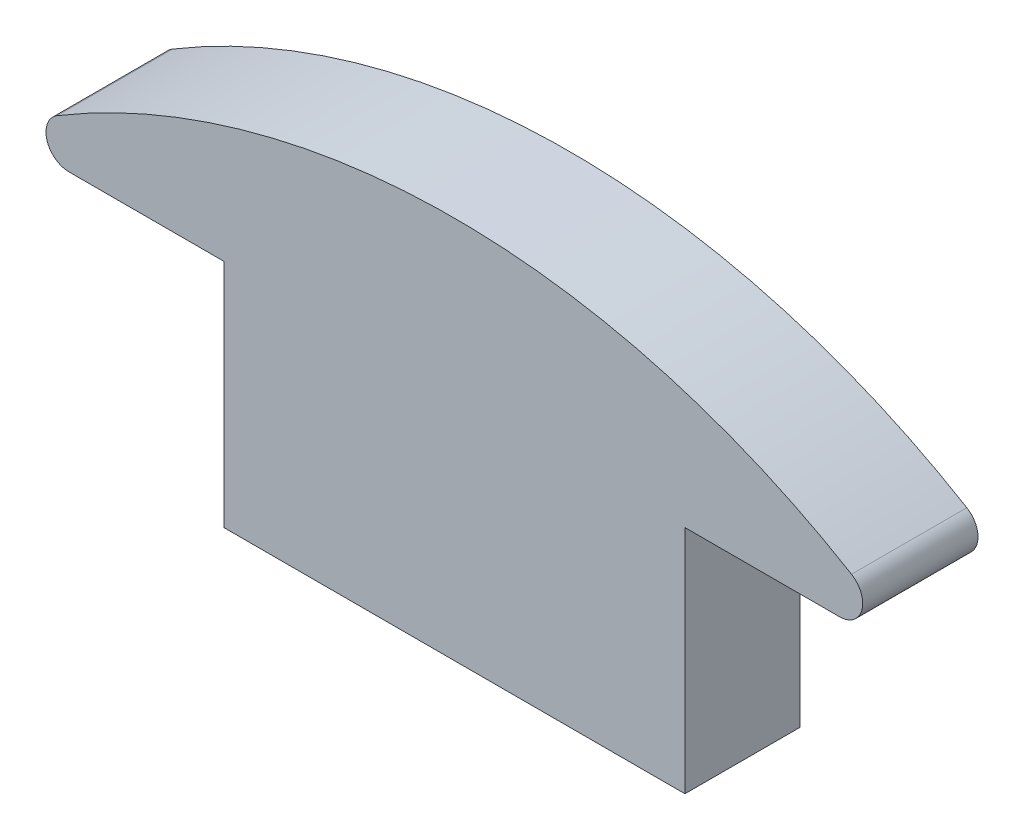
ISO-10303-21;
HEADER;
FILE_DESCRIPTION(('STEP AP214'),'2;1');
FILE_NAME('part.step','',(''),(''),'','','');
FILE_SCHEMA(('AUTOMOTIVE_DESIGN { 1 0 10303 214 1 1 1 1 }'));
ENDSEC;
DATA;
#1=APPLICATION_CONTEXT('core data for automotive mechanical design processes');
#2=APPLICATION_PROTOCOL_DEFINITION('international standard','automotive_design',2000,#1);
#3=PRODUCT_CONTEXT('',#1,'mechanical');
#4=PRODUCT('Part','Part','',(#3));
#5=PRODUCT_RELATED_PRODUCT_CATEGORY('part','',(#4));
#6=PRODUCT_DEFINITION_FORMATION('','',#4);
#7=PRODUCT_DEFINITION_CONTEXT('part definition',#1,'design');
#8=PRODUCT_DEFINITION('design','',#6,#7);
#9=PRODUCT_DEFINITION_SHAPE('','',#8);
#10=(LENGTH_UNIT() NAMED_UNIT(*) SI_UNIT(.MILLI.,.METRE.));
#11=(NAMED_UNIT(*) PLANE_ANGLE_UNIT() SI_UNIT($,.RADIAN.));
#12=(NAMED_UNIT(*) SI_UNIT($,.STERADIAN.) SOLID_ANGLE_UNIT());
#13=UNCERTAINTY_MEASURE_WITH_UNIT(LENGTH_MEASURE(1.E-05),#10,'distance_accuracy_value','');
#14=(GEOMETRIC_REPRESENTATION_CONTEXT(3) GLOBAL_UNCERTAINTY_ASSIGNED_CONTEXT((#13)) GLOBAL_UNIT_ASSIGNED_CONTEXT((#10,
#11,#12)) REPRESENTATION_CONTEXT('',''));
#15=CARTESIAN_POINT('',(0.,0.,0.));
#16=DIRECTION('',(0.,0.,1.));
#17=DIRECTION('',(1.,0.,0.));
#18=AXIS2_PLACEMENT_3D('',#15,#16,#17);
#19=CARTESIAN_POINT('',(2.67102100079534,1.1,0.));
#20=DIRECTION('',(0.,0.,1.));
#21=DIRECTION('',(1.,0.,0.));
#22=AXIS2_PLACEMENT_3D('',#19,#20,#21);
#23=PLANE('',#22);
#24=DIRECTION('',(1.,0.,0.));
#25=VECTOR('',#24,1.);
#26=CARTESIAN_POINT('',(2.67102100079534,1.,0.));
#27=LINE('',#26,#25);
#28=CARTESIAN_POINT('',(-0.67102100079534,1.,0.));
#29=VERTEX_POINT('',#28);
#30=CARTESIAN_POINT('',(0.,1.,0.));
#31=VERTEX_POINT('',#30);
#32=EDGE_CURVE('E88',#29,#31,#27,.T.);
#33=ORIENTED_EDGE('',*,*,#32,.F.);
#34=CARTESIAN_POINT('',(-0.67102100079534,1.1,0.));
#35=DIRECTION('',(0.,0.,-1.));
#36=DIRECTION('',(-1.,0.,0.));
#37=AXIS2_PLACEMENT_3D('',#34,#35,#36);
#38=CIRCLE('',#37,0.0999999999999997);
#39=CARTESIAN_POINT('',(-0.722430179358692,1.1857735178213,0.));
#40=VERTEX_POINT('',#39);
#41=EDGE_CURVE('E19',#40,#29,#38,.F.);
#42=ORIENTED_EDGE('',*,*,#41,.F.);
#43=CARTESIAN_POINT('',(1.,-1.68801088826708,0.));
#44=DIRECTION('',(0.,0.,-1.));
#45=DIRECTION('',(-1.,0.,0.));
#46=AXIS2_PLACEMENT_3D('',#43,#44,#45);
#47=CIRCLE('',#46,3.35043318623762);
#48=CARTESIAN_POINT('',(2.72243017935869,1.1857735178213,0.));
#49=VERTEX_POINT('',#48);
#50=EDGE_CURVE('E91',#49,#40,#47,.F.);
#51=ORIENTED_EDGE('',*,*,#50,.F.);
#52=CARTESIAN_POINT('',(2.67102100079534,1.1,0.));
#53=DIRECTION('',(0.,0.,-1.));
#54=DIRECTION('',(-1.,0.,0.));
#55=AXIS2_PLACEMENT_3D('',#52,#53,#54);
#56=CIRCLE('',#55,0.0999999999999998);
#57=CARTESIAN_POINT('',(2.67102100079534,1.,0.));
#58=VERTEX_POINT('',#57);
#59=EDGE_CURVE('E113',#58,#49,#56,.F.);
#60=ORIENTED_EDGE('',*,*,#59,.F.);
#61=DIRECTION('',(1.,0.,0.));
#62=VECTOR('',#61,1.);
#63=CARTESIAN_POINT('',(2.,1.,0.));
#64=LINE('',#63,#62);
#65=CARTESIAN_POINT('',(2.,1.,0.));
#66=VERTEX_POINT('',#65);
#67=EDGE_CURVE('E116',#58,#66,#64,.F.);
#68=ORIENTED_EDGE('',*,*,#67,.T.);
#69=DIRECTION('',(0.,1.,0.));
#70=VECTOR('',#69,1.);
#71=CARTESIAN_POINT('',(2.,1.,0.));
#72=LINE('',#71,#70);
#73=CARTESIAN_POINT('',(2.,0.,0.));
#74=VERTEX_POINT('',#73);
#75=EDGE_CURVE('E117',#66,#74,#72,.F.);
#76=ORIENTED_EDGE('',*,*,#75,.T.);
#77=DIRECTION('',(1.,0.,0.));
#78=VECTOR('',#77,1.);
#79=CARTESIAN_POINT('',(0.,0.,0.));
#80=LINE('',#79,#78);
#81=CARTESIAN_POINT('',(0.,0.,0.));
#82=VERTEX_POINT('',#81);
#83=EDGE_CURVE('E129',#74,#82,#80,.F.);
#84=ORIENTED_EDGE('',*,*,#83,.T.);
#85=DIRECTION('',(0.,1.,0.));
#86=VECTOR('',#85,1.);
#87=CARTESIAN_POINT('',(0.,1.,0.));
#88=LINE('',#87,#86);
#89=EDGE_CURVE('E66',#82,#31,#88,.T.);
#90=ORIENTED_EDGE('',*,*,#89,.T.);
#91=EDGE_LOOP('',(#33,#42,#51,#60,#68,#76,#84,#90));
#92=FACE_BOUND('',#91,.T.);
#93=ADVANCED_FACE('F16',(#92),#23,.F.);
#94=CARTESIAN_POINT('',(0.,1.,0.5));
#95=DIRECTION('',(1.,0.,0.));
#96=DIRECTION('',(0.,0.,-1.));
#97=AXIS2_PLACEMENT_3D('',#94,#95,#96);
#98=PLANE('',#97);
#99=DIRECTION('',(0.,0.,1.));
#100=VECTOR('',#99,1.);
#101=CARTESIAN_POINT('',(0.,0.,0.5));
#102=LINE('',#101,#100);
#103=CARTESIAN_POINT('',(0.,0.,0.5));
#104=VERTEX_POINT('',#103);
#105=EDGE_CURVE('E136',#82,#104,#102,.T.);
#106=ORIENTED_EDGE('',*,*,#105,.T.);
#107=DIRECTION('',(0.,1.,0.));
#108=VECTOR('',#107,1.);
#109=CARTESIAN_POINT('',(0.,1.1,0.5));
#110=LINE('',#109,#108);
#111=CARTESIAN_POINT('',(0.,1.,0.5));
#112=VERTEX_POINT('',#111);
#113=EDGE_CURVE('E83',#112,#104,#110,.F.);
#114=ORIENTED_EDGE('',*,*,#113,.F.);
#115=DIRECTION('',(0.,0.,1.));
#116=VECTOR('',#115,1.);
#117=CARTESIAN_POINT('',(0.,1.,0.5));
#118=LINE('',#117,#116);
#119=EDGE_CURVE('E104',#112,#31,#118,.F.);
#120=ORIENTED_EDGE('',*,*,#119,.T.);
#121=ORIENTED_EDGE('',*,*,#89,.F.);
#122=EDGE_LOOP('',(#106,#114,#120,#121));
#123=FACE_BOUND('',#122,.T.);
#124=ADVANCED_FACE('F179',(#123),#98,.F.);
#125=CARTESIAN_POINT('',(0.,0.,0.5));
#126=DIRECTION('',(0.,1.,0.));
#127=DIRECTION('',(0.,0.,1.));
#128=AXIS2_PLACEMENT_3D('',#125,#126,#127);
#129=PLANE('',#128);
#130=DIRECTION('',(0.,0.,1.));
#131=VECTOR('',#130,1.);
#132=CARTESIAN_POINT('',(2.,0.,0.5));
#133=LINE('',#132,#131);
#134=CARTESIAN_POINT('',(2.,0.,0.5));
#135=VERTEX_POINT('',#134);
#136=EDGE_CURVE('E127',#74,#135,#133,.T.);
#137=ORIENTED_EDGE('',*,*,#136,.T.);
#138=DIRECTION('',(1.,0.,0.));
#139=VECTOR('',#138,1.);
#140=CARTESIAN_POINT('',(2.67102100079534,0.,0.5));
#141=LINE('',#140,#139);
#142=EDGE_CURVE('E124',#104,#135,#141,.T.);
#143=ORIENTED_EDGE('',*,*,#142,.F.);
#144=ORIENTED_EDGE('',*,*,#105,.F.);
#145=ORIENTED_EDGE('',*,*,#83,.F.);
#146=EDGE_LOOP('',(#137,#143,#144,#145));
#147=FACE_BOUND('',#146,.T.);
#148=ADVANCED_FACE('F178',(#147),#129,.F.);
#149=CARTESIAN_POINT('',(2.,1.,0.5));
#150=DIRECTION('',(-1.,0.,0.));
#151=DIRECTION('',(0.,0.,1.));
#152=AXIS2_PLACEMENT_3D('',#149,#150,#151);
#153=PLANE('',#152);
#154=DIRECTION('',(0.,0.,1.));
#155=VECTOR('',#154,1.);
#156=CARTESIAN_POINT('',(2.,1.,0.5));
#157=LINE('',#156,#155);
#158=CARTESIAN_POINT('',(2.,1.,0.5));
#159=VERTEX_POINT('',#158);
#160=EDGE_CURVE('E114',#66,#159,#157,.T.);
#161=ORIENTED_EDGE('',*,*,#160,.T.);
#162=DIRECTION('',(0.,1.,0.));
#163=VECTOR('',#162,1.);
#164=CARTESIAN_POINT('',(2.,1.1,0.5));
#165=LINE('',#164,#163);
#166=EDGE_CURVE('E120',#135,#159,#165,.T.);
#167=ORIENTED_EDGE('',*,*,#166,.F.);
#168=ORIENTED_EDGE('',*,*,#136,.F.);
#169=ORIENTED_EDGE('',*,*,#75,.F.);
#170=EDGE_LOOP('',(#161,#167,#168,#169));
#171=FACE_BOUND('',#170,.T.);
#172=ADVANCED_FACE('F173',(#171),#153,.F.);
#173=CARTESIAN_POINT('',(2.,1.,0.5));
#174=DIRECTION('',(0.,1.,0.));
#175=DIRECTION('',(0.,0.,1.));
#176=AXIS2_PLACEMENT_3D('',#173,#174,#175);
#177=PLANE('',#176);
#178=DIRECTION('',(0.,0.,-1.));
#179=VECTOR('',#178,1.);
#180=CARTESIAN_POINT('',(2.67102100079534,1.,0.5));
#181=LINE('',#180,#179);
#182=CARTESIAN_POINT('',(2.67102100079534,1.,0.5));
#183=VERTEX_POINT('',#182);
#184=EDGE_CURVE('E99',#183,#58,#181,.T.);
#185=ORIENTED_EDGE('',*,*,#184,.F.);
#186=DIRECTION('',(1.,0.,0.));
#187=VECTOR('',#186,1.);
#188=CARTESIAN_POINT('',(2.67102100079534,1.,0.5));
#189=LINE('',#188,#187);
#190=EDGE_CURVE('E123',#159,#183,#189,.T.);
#191=ORIENTED_EDGE('',*,*,#190,.F.);
#192=ORIENTED_EDGE('',*,*,#160,.F.);
#193=ORIENTED_EDGE('',*,*,#67,.F.);
#194=EDGE_LOOP('',(#185,#191,#192,#193));
#195=FACE_BOUND('',#194,.T.);
#196=ADVANCED_FACE('F168',(#195),#177,.F.);
#197=CARTESIAN_POINT('',(2.67102100079534,1.1,0.5));
#198=DIRECTION('',(0.,0.,-1.));
#199=DIRECTION('',(-1.,0.,0.));
#200=AXIS2_PLACEMENT_3D('',#197,#198,#199);
#201=CYLINDRICAL_SURFACE('',#200,0.0999999999999998);
#202=CARTESIAN_POINT('',(2.67102100079534,1.1,0.5));
#203=DIRECTION('',(0.,0.,-1.));
#204=DIRECTION('',(-1.,0.,0.));
#205=AXIS2_PLACEMENT_3D('',#202,#203,#204);
#206=CIRCLE('',#205,0.0999999999999998);
#207=CARTESIAN_POINT('',(2.72243017935869,1.1857735178213,0.5));
#208=VERTEX_POINT('',#207);
#209=EDGE_CURVE('E160',#183,#208,#206,.F.);
#210=ORIENTED_EDGE('',*,*,#209,.F.);
#211=ORIENTED_EDGE('',*,*,#184,.T.);
#212=ORIENTED_EDGE('',*,*,#59,.T.);
#213=DIRECTION('',(0.,0.,-1.));
#214=VECTOR('',#213,1.);
#215=CARTESIAN_POINT('',(2.72243017935869,1.1857735178213,0.5));
#216=LINE('',#215,#214);
#217=EDGE_CURVE('E98',#208,#49,#216,.T.);
#218=ORIENTED_EDGE('',*,*,#217,.F.);
#219=EDGE_LOOP('',(#210,#211,#212,#218));
#220=FACE_BOUND('',#219,.T.);
#221=ADVANCED_FACE('F164',(#220),#201,.T.);
#222=CARTESIAN_POINT('',(1.,-1.68801088826708,0.5));
#223=DIRECTION('',(0.,0.,-1.));
#224=DIRECTION('',(-1.,0.,0.));
#225=AXIS2_PLACEMENT_3D('',#222,#223,#224);
#226=CYLINDRICAL_SURFACE('',#225,3.35043318623762);
#227=CARTESIAN_POINT('',(1.,-1.68801088826708,0.5));
#228=DIRECTION('',(0.,0.,-1.));
#229=DIRECTION('',(-1.,0.,0.));
#230=AXIS2_PLACEMENT_3D('',#227,#228,#229);
#231=CIRCLE('',#230,3.35043318623762);
#232=CARTESIAN_POINT('',(-0.722430179358692,1.1857735178213,0.5));
#233=VERTEX_POINT('',#232);
#234=EDGE_CURVE('E158',#208,#233,#231,.F.);
#235=ORIENTED_EDGE('',*,*,#234,.F.);
#236=ORIENTED_EDGE('',*,*,#217,.T.);
#237=ORIENTED_EDGE('',*,*,#50,.T.);
#238=DIRECTION('',(0.,0.,-1.));
#239=VECTOR('',#238,1.);
#240=CARTESIAN_POINT('',(-0.722430179358692,1.1857735178213,0.5));
#241=LINE('',#240,#239);
#242=EDGE_CURVE('E97',#233,#40,#241,.T.);
#243=ORIENTED_EDGE('',*,*,#242,.F.);
#244=EDGE_LOOP('',(#235,#236,#237,#243));
#245=FACE_BOUND('',#244,.T.);
#246=ADVANCED_FACE('F96',(#245),#226,.T.);
#247=CARTESIAN_POINT('',(-0.67102100079534,1.1,0.5));
#248=DIRECTION('',(0.,0.,-1.));
#249=DIRECTION('',(-1.,0.,0.));
#250=AXIS2_PLACEMENT_3D('',#247,#248,#249);
#251=CYLINDRICAL_SURFACE('',#250,0.0999999999999997);
#252=ORIENTED_EDGE('',*,*,#41,.T.);
#253=DIRECTION('',(0.,0.,1.));
#254=VECTOR('',#253,1.);
#255=CARTESIAN_POINT('',(-0.67102100079534,1.,0.5));
#256=LINE('',#255,#254);
#257=CARTESIAN_POINT('',(-0.67102100079534,1.,0.5));
#258=VERTEX_POINT('',#257);
#259=EDGE_CURVE('E102',#29,#258,#256,.T.);
#260=ORIENTED_EDGE('',*,*,#259,.T.);
#261=CARTESIAN_POINT('',(-0.67102100079534,1.1,0.5));
#262=DIRECTION('',(0.,0.,-1.));
#263=DIRECTION('',(-1.,0.,0.));
#264=AXIS2_PLACEMENT_3D('',#261,#262,#263);
#265=CIRCLE('',#264,0.0999999999999997);
#266=EDGE_CURVE('E25',#233,#258,#265,.F.);
#267=ORIENTED_EDGE('',*,*,#266,.F.);
#268=ORIENTED_EDGE('',*,*,#242,.T.);
#269=EDGE_LOOP('',(#252,#260,#267,#268));
#270=FACE_BOUND('',#269,.T.);
#271=ADVANCED_FACE('F101',(#270),#251,.T.);
#272=CARTESIAN_POINT('',(0.,1.,0.5));
#273=DIRECTION('',(0.,1.,0.));
#274=DIRECTION('',(-1.,0.,0.));
#275=AXIS2_PLACEMENT_3D('',#272,#273,#274);
#276=PLANE('',#275);
#277=ORIENTED_EDGE('',*,*,#119,.F.);
#278=DIRECTION('',(1.,0.,0.));
#279=VECTOR('',#278,1.);
#280=CARTESIAN_POINT('',(2.67102100079534,1.,0.5));
#281=LINE('',#280,#279);
#282=EDGE_CURVE('E11',#258,#112,#281,.T.);
#283=ORIENTED_EDGE('',*,*,#282,.F.);
#284=ORIENTED_EDGE('',*,*,#259,.F.);
#285=ORIENTED_EDGE('',*,*,#32,.T.);
#286=EDGE_LOOP('',(#277,#283,#284,#285));
#287=FACE_BOUND('',#286,.T.);
#288=ADVANCED_FACE('F190',(#287),#276,.F.);
#289=CARTESIAN_POINT('',(2.67102100079534,1.1,0.5));
#290=DIRECTION('',(0.,0.,1.));
#291=DIRECTION('',(1.,0.,0.));
#292=AXIS2_PLACEMENT_3D('',#289,#290,#291);
#293=PLANE('',#292);
#294=ORIENTED_EDGE('',*,*,#266,.T.);
#295=ORIENTED_EDGE('',*,*,#282,.T.);
#296=ORIENTED_EDGE('',*,*,#113,.T.);
#297=ORIENTED_EDGE('',*,*,#142,.T.);
#298=ORIENTED_EDGE('',*,*,#166,.T.);
#299=ORIENTED_EDGE('',*,*,#190,.T.);
#300=ORIENTED_EDGE('',*,*,#209,.T.);
#301=ORIENTED_EDGE('',*,*,#234,.T.);
#302=EDGE_LOOP('',(#294,#295,#296,#297,#298,#299,#300,#301));
#303=FACE_BOUND('',#302,.T.);
#304=ADVANCED_FACE('F188',(#303),#293,.T.);
#305=CLOSED_SHELL('',(#93,#124,#148,#172,#196,#221,#246,#271,#288,#304));
#306=MANIFOLD_SOLID_BREP('B1',#305);
#307=ADVANCED_BREP_SHAPE_REPRESENTATION('',(#18,#306),#14);
#308=SHAPE_DEFINITION_REPRESENTATION(#9,#307);
ENDSEC;
END-ISO-10303-21;
